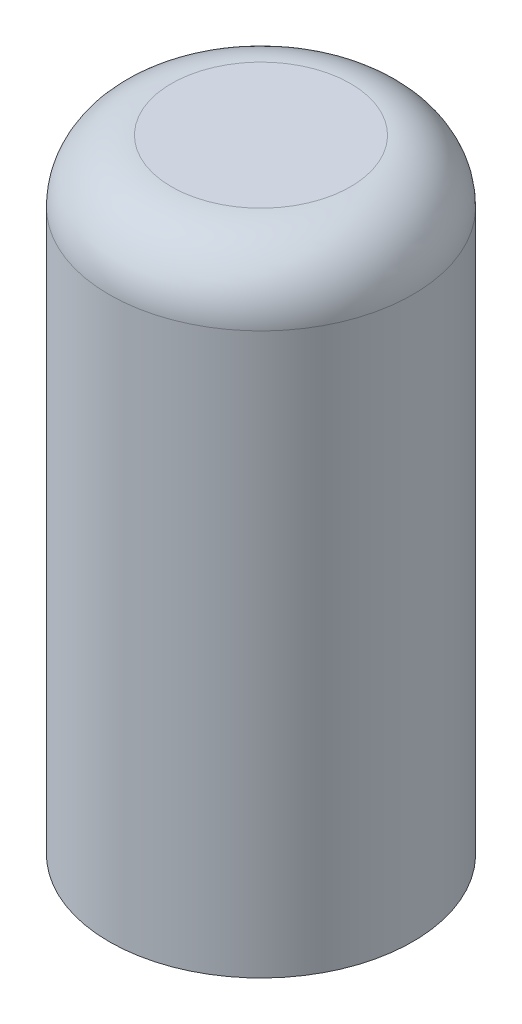
ISO-10303-21;
HEADER;
FILE_DESCRIPTION(('STEP AP214'),'2;1');
FILE_NAME('part.step','',(''),(''),'','','');
FILE_SCHEMA(('AUTOMOTIVE_DESIGN { 1 0 10303 214 1 1 1 1 }'));
ENDSEC;
DATA;
#1=APPLICATION_CONTEXT('core data for automotive mechanical design processes');
#2=APPLICATION_PROTOCOL_DEFINITION('international standard','automotive_design',2000,#1);
#3=PRODUCT_CONTEXT('',#1,'mechanical');
#4=PRODUCT('Part','Part','',(#3));
#5=PRODUCT_RELATED_PRODUCT_CATEGORY('part','',(#4));
#6=PRODUCT_DEFINITION_FORMATION('','',#4);
#7=PRODUCT_DEFINITION_CONTEXT('part definition',#1,'design');
#8=PRODUCT_DEFINITION('design','',#6,#7);
#9=PRODUCT_DEFINITION_SHAPE('','',#8);
#10=(LENGTH_UNIT() NAMED_UNIT(*) SI_UNIT(.MILLI.,.METRE.));
#11=(NAMED_UNIT(*) PLANE_ANGLE_UNIT() SI_UNIT($,.RADIAN.));
#12=(NAMED_UNIT(*) SI_UNIT($,.STERADIAN.) SOLID_ANGLE_UNIT());
#13=UNCERTAINTY_MEASURE_WITH_UNIT(LENGTH_MEASURE(1.E-05),#10,'distance_accuracy_value','');
#14=(GEOMETRIC_REPRESENTATION_CONTEXT(3) GLOBAL_UNCERTAINTY_ASSIGNED_CONTEXT((#13)) GLOBAL_UNIT_ASSIGNED_CONTEXT((#10,
#11,#12)) REPRESENTATION_CONTEXT('',''));
#15=CARTESIAN_POINT('',(0.,0.,0.));
#16=DIRECTION('',(0.,0.,1.));
#17=DIRECTION('',(1.,0.,0.));
#18=AXIS2_PLACEMENT_3D('',#15,#16,#17);
#19=CARTESIAN_POINT('',(0.,650.,0.));
#20=DIRECTION('',(0.,-1.,0.));
#21=DIRECTION('',(0.,0.,-1.));
#22=AXIS2_PLACEMENT_3D('',#19,#20,#21);
#23=CYLINDRICAL_SURFACE('',#22,97.5);
#24=CARTESIAN_POINT('',(0.,610.,0.));
#25=DIRECTION('',(0.,1.,0.));
#26=DIRECTION('',(0.,0.,1.));
#27=AXIS2_PLACEMENT_3D('',#24,#25,#26);
#28=CIRCLE('',#27,97.5);
#29=CARTESIAN_POINT('',(0.,610.,97.5));
#30=VERTEX_POINT('',#29);
#31=EDGE_CURVE('E10',#30,#30,#28,.F.);
#32=ORIENTED_EDGE('',*,*,#31,.T.);
#33=EDGE_LOOP('',(#32));
#34=FACE_BOUND('',#33,.T.);
#35=CARTESIAN_POINT('',(0.,517.5,-97.5));
#36=CARTESIAN_POINT('',(-0.841058769655879,517.500000131074,-97.5000001229896));
#37=CARTESIAN_POINT('',(-1.68211410689393,517.484275204085,-97.4891116312973));
#38=CARTESIAN_POINT('',(-3.3625733468422,517.421436789515,-97.445623930377));
#39=CARTESIAN_POINT('',(-4.20197707672122,517.374320175706,-97.4130225588109));
#40=CARTESIAN_POINT('',(-5.87722091904814,517.248893898886,-97.3263154491367));
#41=CARTESIAN_POINT('',(-6.71306148766499,517.170588357888,-97.2722125527299));
#42=CARTESIAN_POINT('',(-8.37971018981653,516.983085624979,-97.1428286429082));
#43=CARTESIAN_POINT('',(-9.21051776996125,516.873885096868,-97.0675453423283));
#44=CARTESIAN_POINT('',(-10.8655958541269,516.624990036185,-96.8962390654577));
#45=CARTESIAN_POINT('',(-11.6898647817588,516.485288368626,-96.8002112365534));
#46=CARTESIAN_POINT('',(-13.3302223700195,516.175916355791,-96.587987056246));
#47=CARTESIAN_POINT('',(-14.1463101496129,516.006242818687,-96.4717885568083));
#48=CARTESIAN_POINT('',(-15.7687155383474,515.637561585911,-96.2199114152539));
#49=CARTESIAN_POINT('',(-16.5750341022946,515.438556782407,-96.0842346937942));
#50=CARTESIAN_POINT('',(-18.1766731055127,515.011889158601,-95.7941612923735));
#51=CARTESIAN_POINT('',(-18.9719924192853,514.7842234293,-95.639762712258));
#52=CARTESIAN_POINT('',(-21.3315736543071,514.061763240673,-95.1513707260226));
#53=CARTESIAN_POINT('',(-22.8779586744453,513.525563939127,-94.7908477808735));
#54=CARTESIAN_POINT('',(-25.9135076979197,512.348948211736,-94.0063789180784));
#55=CARTESIAN_POINT('',(-27.4026720822885,511.708532480018,-93.5824334228558));
#56=CARTESIAN_POINT('',(-30.3174869793471,510.329917355252,-92.6791655127556));
#57=CARTESIAN_POINT('',(-31.743138054015,509.591718827635,-92.1998435879944));
#58=CARTESIAN_POINT('',(-34.5258511089924,508.023845938994,-91.1943250089744));
#59=CARTESIAN_POINT('',(-35.8829097302275,507.194167104361,-90.6681260625573));
#60=CARTESIAN_POINT('',(-38.6402805472691,505.372761066792,-89.5298475990137));
#61=CARTESIAN_POINT('',(-40.0339817579561,504.37320636702,-88.9142824248913));
#62=CARTESIAN_POINT('',(-42.7320513400252,502.27942494267,-87.6495410647169));
#63=CARTESIAN_POINT('',(-44.0364155064493,501.185193767293,-87.0003632990936));
#64=CARTESIAN_POINT('',(-46.5546722448273,498.906038745041,-85.6792672988249));
#65=CARTESIAN_POINT('',(-47.7684377473407,497.72099207349,-85.0073189777336));
#66=CARTESIAN_POINT('',(-50.1010073905835,495.265951678956,-83.6537960086101));
#67=CARTESIAN_POINT('',(-51.2198059981249,493.995953013995,-82.9722208023684));
#68=CARTESIAN_POINT('',(-53.5438526277285,491.148986538016,-81.4954754480966));
#69=CARTESIAN_POINT('',(-54.7308877983648,489.556784542845,-80.7009240543854));
#70=CARTESIAN_POINT('',(-56.9660666294683,486.263993423805,-79.1389657456395));
#71=CARTESIAN_POINT('',(-58.0141752763636,484.563377135673,-78.3715657091349));
#72=CARTESIAN_POINT('',(-59.4756432904379,481.935877701174,-77.2610669377098));
#73=CARTESIAN_POINT('',(-59.9441264360605,481.047783472077,-76.8978532075739));
#74=CARTESIAN_POINT('',(-60.8434455329142,479.246183538453,-76.18827437373));
#75=CARTESIAN_POINT('',(-61.2742804044033,478.3326771061,-75.841909753376));
#76=CARTESIAN_POINT('',(-62.5080329565272,475.555732567874,-74.8339659024154));
#77=CARTESIAN_POINT('',(-63.2529715295133,473.654484848413,-74.2029407011636));
#78=CARTESIAN_POINT('',(-64.3724522075475,470.358547826576,-73.2311880616067));
#79=CARTESIAN_POINT('',(-64.790544652281,468.987167434664,-72.8607586588913));
#80=CARTESIAN_POINT('',(-65.5416795781276,466.205322212768,-72.1858246415491));
#81=CARTESIAN_POINT('',(-65.8747358661739,464.794863768988,-71.8813093259761));
#82=CARTESIAN_POINT('',(-66.4507960080894,461.943752883125,-71.3491120682116));
#83=CARTESIAN_POINT('',(-66.6939461112358,460.503153541098,-71.1213053994296));
#84=CARTESIAN_POINT('',(-67.0869828480862,457.598311780572,-70.7506898904034));
#85=CARTESIAN_POINT('',(-67.2368695119559,456.134069369719,-70.6078810226669));
#86=CARTESIAN_POINT('',(-67.4411083426006,453.184854457998,-70.4128347794516));
#87=CARTESIAN_POINT('',(-67.494940013156,451.699812699854,-70.3610908811681));
#88=CARTESIAN_POINT('',(-67.5043785417708,448.729127512175,-70.3520356909658));
#89=CARTESIAN_POINT('',(-67.459985582757,447.243484083764,-70.3947242231826));
#90=CARTESIAN_POINT('',(-67.2738286324482,444.283068671458,-70.5726454290871));
#91=CARTESIAN_POINT('',(-67.1320051865069,442.808303881707,-70.7079346099417));
#92=CARTESIAN_POINT('',(-66.7536362818973,439.881727643169,-71.0652469462868));
#93=CARTESIAN_POINT('',(-66.517088771669,438.429916692232,-71.2872719803239));
#94=CARTESIAN_POINT('',(-65.9704393765082,435.645910752998,-71.7933189945174));
#95=CARTESIAN_POINT('',(-65.6656890511374,434.311812734073,-72.0727464451116));
#96=CARTESIAN_POINT('',(-64.9799912353044,431.677803227118,-72.6915662238878));
#97=CARTESIAN_POINT('',(-64.5990493075136,430.377889251182,-73.0309541742037));
#98=CARTESIAN_POINT('',(-63.7645147730452,427.815467528686,-73.7607193505714));
#99=CARTESIAN_POINT('',(-63.3108790810794,426.552982495256,-74.1511267901839));
#100=CARTESIAN_POINT('',(-62.3346744229028,424.068936487996,-74.9736360253282));
#101=CARTESIAN_POINT('',(-61.812094440811,422.847382093235,-75.4057444808568));
#102=CARTESIAN_POINT('',(-60.4151420304235,419.829277491387,-76.533836285721));
#103=CARTESIAN_POINT('',(-59.4980892583007,418.060193391293,-77.2512147100701));
#104=CARTESIAN_POINT('',(-58.0161474830264,415.483929468787,-78.3629970249596));
#105=CARTESIAN_POINT('',(-57.5042631313741,414.637816149105,-78.739666910215));
#106=CARTESIAN_POINT('',(-56.4457922829122,412.971681220428,-79.5018727406844));
#107=CARTESIAN_POINT('',(-55.8992065946864,412.151659004145,-79.8874084791797));
#108=CARTESIAN_POINT('',(-54.2066245309442,409.728680092151,-81.0541211889856));
#109=CARTESIAN_POINT('',(-53.0093230905132,408.165448346478,-81.8442482577446));
#110=CARTESIAN_POINT('',(-50.4837212715677,405.150125320249,-83.4258027761796));
#111=CARTESIAN_POINT('',(-49.1554371145908,403.698020316678,-84.2172300529237));
#112=CARTESIAN_POINT('',(-46.3568268550921,400.895439710074,-85.789851348241));
#113=CARTESIAN_POINT('',(-44.885139118274,399.546210631213,-86.5708467253269));
#114=CARTESIAN_POINT('',(-41.815601541671,396.974411864322,-88.0944949107013));
#115=CARTESIAN_POINT('',(-40.2177402288645,395.751853717963,-88.837144221986));
#116=CARTESIAN_POINT('',(-37.732599159874,394.022166220727,-89.9072516592096));
#117=CARTESIAN_POINT('',(-36.8901501829687,393.463337248748,-90.2564007795345));
#118=CARTESIAN_POINT('',(-35.1761946674018,392.381321483449,-90.9380857260168));
#119=CARTESIAN_POINT('',(-34.3046916433119,391.858130402265,-91.2706235495165));
#120=CARTESIAN_POINT('',(-32.5337664697387,390.848986108771,-91.9167682576983));
#121=CARTESIAN_POINT('',(-31.6343493315236,390.363026266253,-92.2303785109151));
#122=CARTESIAN_POINT('',(-29.8087919840112,389.429900791862,-92.8364753156058));
#123=CARTESIAN_POINT('',(-28.8826534851014,388.982732684306,-93.1289632149052));
#124=CARTESIAN_POINT('',(-26.4825572070576,387.891226830316,-93.8469429645498));
#125=CARTESIAN_POINT('',(-24.9904145873387,387.275560726021,-94.2559266238759));
#126=CARTESIAN_POINT('',(-21.9517006765951,386.148620830874,-95.0095953671133));
#127=CARTESIAN_POINT('',(-20.4051369659291,385.637332568098,-95.3542893641739));
#128=CARTESIAN_POINT('',(-17.266531413211,384.72530629406,-95.9722519280153));
#129=CARTESIAN_POINT('',(-15.674512886748,384.324512691232,-96.2455564083132));
#130=CARTESIAN_POINT('',(-12.454451018113,383.638517525164,-96.7149612880226));
#131=CARTESIAN_POINT('',(-10.8264069113131,383.353318417856,-96.9110600471115));
#132=CARTESIAN_POINT('',(-7.53974785300756,382.901833467091,-97.222101459197));
#133=CARTESIAN_POINT('',(-5.88103963745256,382.73600764206,-97.3367301367258));
#134=CARTESIAN_POINT('',(-2.55217998153672,382.52765424955,-97.4808276111811));
#135=CARTESIAN_POINT('',(-0.8820285460783,382.485126629253,-97.5102964445889));
#136=CARTESIAN_POINT('',(2.45612665393036,382.524050663574,-97.4833501574838));
#137=CARTESIAN_POINT('',(4.12413041115404,382.60550274002,-97.4269347447598));
#138=CARTESIAN_POINT('',(7.44448423057918,382.891087804018,-97.229601634782));
#139=CARTESIAN_POINT('',(9.09683477994216,383.095216960771,-97.0886865761737));
#140=CARTESIAN_POINT('',(12.2738167332787,383.606976303807,-96.736763553081));
#141=CARTESIAN_POINT('',(13.8001193986528,383.907583821032,-96.5305213015223));
#142=CARTESIAN_POINT('',(16.8182005718024,384.610407971798,-96.0506784096405));
#143=CARTESIAN_POINT('',(18.3099807717222,385.012619613573,-95.77708107846));
#144=CARTESIAN_POINT('',(21.2509611909264,385.914021898447,-95.167758787226));
#145=CARTESIAN_POINT('',(22.700157990089,386.413220306743,-94.8320288526584));
#146=CARTESIAN_POINT('',(25.5490529231857,387.503419782869,-94.1045045290518));
#147=CARTESIAN_POINT('',(26.9487482853309,388.094425981435,-93.7127070067372));
#148=CARTESIAN_POINT('',(29.7956147658313,389.410308730664,-92.8485127627575));
#149=CARTESIAN_POINT('',(31.2385210393806,390.141887770652,-92.3722814292721));
#150=CARTESIAN_POINT('',(34.0553647496094,391.698438572814,-91.3713129587121));
#151=CARTESIAN_POINT('',(35.4292994679814,392.523414011764,-90.8465739121632));
#152=CARTESIAN_POINT('',(38.1048837530086,394.261198788088,-89.7572020694093));
#153=CARTESIAN_POINT('',(39.4064944714931,395.174054623871,-89.1925481963159));
#154=CARTESIAN_POINT('',(41.933631748725,397.081878873506,-88.0326866505505));
#155=CARTESIAN_POINT('',(43.159154202171,398.076851711204,-87.4374773324357));
#156=CARTESIAN_POINT('',(45.7334563124867,400.320119872926,-86.1227567780688));
#157=CARTESIAN_POINT('',(47.0677818010393,401.582728114568,-85.399313182882));
#158=CARTESIAN_POINT('',(49.6258563322756,404.208247133162,-83.938633966364));
#159=CARTESIAN_POINT('',(50.8495889275213,405.571172774865,-83.2013963131873));
#160=CARTESIAN_POINT('',(53.1838049211151,408.393642759901,-81.7290525581094));
#161=CARTESIAN_POINT('',(54.2942128479666,409.853250437999,-80.9939481894175));
#162=CARTESIAN_POINT('',(56.3967753541518,412.864765044543,-79.5442252496152));
#163=CARTESIAN_POINT('',(57.3889454919879,414.416659788878,-78.8296039926225));
#164=CARTESIAN_POINT('',(59.1436520346959,417.427648891688,-77.519912021589));
#165=CARTESIAN_POINT('',(59.9194729027744,418.877117365786,-76.9205058727223));
#166=CARTESIAN_POINT('',(61.3695954992595,421.844202772217,-75.7685961823368));
#167=CARTESIAN_POINT('',(62.0438965136772,423.361820183745,-75.2160929706981));
#168=CARTESIAN_POINT('',(63.2839951939035,426.459304102406,-74.1757393383543));
#169=CARTESIAN_POINT('',(63.8499663044206,428.039066137575,-73.68778596187));
#170=CARTESIAN_POINT('',(64.867664792584,431.257476444707,-72.7935147031526));
#171=CARTESIAN_POINT('',(65.3194199173756,432.896110303908,-72.387176998496));
#172=CARTESIAN_POINT('',(66.0280312291772,435.911755500848,-71.7407415618537));
#173=CARTESIAN_POINT('',(66.3055419109814,437.280309696444,-71.483762985774));
#174=CARTESIAN_POINT('',(66.7763748667453,440.043636259976,-71.0441410429634));
#175=CARTESIAN_POINT('',(66.9697075658925,441.438405358944,-70.8614884713659));
#176=CARTESIAN_POINT('',(67.2689335025054,444.244218962747,-70.5774992355427));
#177=CARTESIAN_POINT('',(67.3749110091313,445.655246447696,-70.4760842063559));
#178=CARTESIAN_POINT('',(67.4978468283115,448.484788252271,-70.3583547399727));
#179=CARTESIAN_POINT('',(67.5148038910335,449.903302676732,-70.3420414975913));
#180=CARTESIAN_POINT('',(67.4593627868347,452.737593020832,-70.3952113161187));
#181=CARTESIAN_POINT('',(67.3869241020864,454.153367407195,-70.4647332810784));
#182=CARTESIAN_POINT('',(67.1539579042256,456.970978369522,-70.6867848438324));
#183=CARTESIAN_POINT('',(66.9934309191762,458.372815028987,-70.8393139440237));
#184=CARTESIAN_POINT('',(66.5867490614229,461.154998978869,-71.221713489735));
#185=CARTESIAN_POINT('',(66.340488506313,462.535317540032,-71.4516793788311));
#186=CARTESIAN_POINT('',(65.7660163823356,465.265246597227,-71.9807833555996));
#187=CARTESIAN_POINT('',(65.4377938477496,466.614852957881,-72.279930698684));
#188=CARTESIAN_POINT('',(64.5937777910564,469.675089263686,-73.0363174365625));
#189=CARTESIAN_POINT('',(64.0512383775696,471.373302143363,-73.5140958447887));
#190=CARTESIAN_POINT('',(62.8432903016605,474.700319298426,-74.5493317490452));
#191=CARTESIAN_POINT('',(62.1778433157733,476.329101729396,-75.1068140850503));
#192=CARTESIAN_POINT('',(60.7308320145228,479.514049443108,-76.2816185285041));
#193=CARTESIAN_POINT('',(59.9491324848465,481.070127355361,-76.8990100222664));
#194=CARTESIAN_POINT('',(58.2763425976617,484.104538286452,-78.1743179290407));
#195=CARTESIAN_POINT('',(57.3852590987321,485.582876171441,-78.8322317999365));
#196=CARTESIAN_POINT('',(55.4771144677629,488.491992245766,-80.1869032477321));
#197=CARTESIAN_POINT('',(54.4576714181876,489.920953883018,-80.8842015810297));
#198=CARTESIAN_POINT('',(52.3130890254323,492.692632858549,-82.2875015857658));
#199=CARTESIAN_POINT('',(51.1879498374726,494.035350323479,-82.9935032444217));
#200=CARTESIAN_POINT('',(48.8347172805761,496.6314355628,-84.3996449516463));
#201=CARTESIAN_POINT('',(47.6065930269225,497.884776323534,-85.0997831720627));
#202=CARTESIAN_POINT('',(45.0501719584955,500.297319306489,-86.4802969723416));
#203=CARTESIAN_POINT('',(43.7218657481426,501.456512677857,-87.1606706902781));
#204=CARTESIAN_POINT('',(41.5457857700001,503.209510176549,-88.2098993118906));
#205=CARTESIAN_POINT('',(40.7299427899988,503.836655034426,-88.589802795815));
#206=CARTESIAN_POINT('',(39.066343624892,505.055735307727,-89.3358914544837));
#207=CARTESIAN_POINT('',(38.2185904597825,505.647674041464,-89.7020779209015));
#208=CARTESIAN_POINT('',(36.4917300624657,506.795058082861,-90.4183484821805));
#209=CARTESIAN_POINT('',(35.6126134591042,507.350492339959,-90.7684276915536));
#210=CARTESIAN_POINT('',(33.8243931886395,508.423002501641,-91.4498537947872));
#211=CARTESIAN_POINT('',(32.9152937821163,508.940083822569,-91.7812033321429));
#212=CARTESIAN_POINT('',(31.0691760344544,509.933746870017,-92.4224546754079));
#213=CARTESIAN_POINT('',(30.1321877671728,510.410370229418,-92.7323784667856));
#214=CARTESIAN_POINT('',(28.2309826068363,511.321878348899,-93.3287414479659));
#215=CARTESIAN_POINT('',(27.2667696548899,511.7567691106,-93.6151840137686));
#216=CARTESIAN_POINT('',(25.3129379677866,512.582984574341,-94.1622756199132));
#217=CARTESIAN_POINT('',(24.3233246816418,512.974318525862,-94.4229301351498));
#218=CARTESIAN_POINT('',(22.3205703247798,513.711699087201,-94.9163078971732));
#219=CARTESIAN_POINT('',(21.3074309624801,514.057748973423,-95.1490331646039));
#220=CARTESIAN_POINT('',(19.4753093467485,514.634981850316,-95.5387127234386));
#221=CARTESIAN_POINT('',(18.6603007915605,514.875017213867,-95.7013093373722));
#222=CARTESIAN_POINT('',(17.0183064833653,515.324971199788,-96.0068985800616));
#223=CARTESIAN_POINT('',(16.1913200835958,515.534888189145,-96.1498901458164));
#224=CARTESIAN_POINT('',(14.5269891104443,515.923795359244,-96.4153857485531));
#225=CARTESIAN_POINT('',(13.6896461896107,516.102790407558,-96.5378930099703));
#226=CARTESIAN_POINT('',(12.0060231713148,516.429215447988,-96.7616997886046));
#227=CARTESIAN_POINT('',(11.1597431864686,516.576645837354,-96.8629995727233));
#228=CARTESIAN_POINT('',(9.46046752987578,516.839271167955,-97.0436968314115));
#229=CARTESIAN_POINT('',(8.60747684577776,516.954488081861,-97.1231092347402));
#230=CARTESIAN_POINT('',(6.89603458935004,517.152339235733,-97.259608961069));
#231=CARTESIAN_POINT('',(6.03758360121015,517.234976903646,-97.3166986328339));
#232=CARTESIAN_POINT('',(4.31688403856741,517.367344769873,-97.4081970531133));
#233=CARTESIAN_POINT('',(3.45463521818759,517.417072805085,-97.4426043107455));
#234=CARTESIAN_POINT('',(1.7282563841433,517.483400265393,-97.4885056605433));
#235=CARTESIAN_POINT('',(0.864126380431263,517.499999865331,-97.4999998736372));
#236=CARTESIAN_POINT('',(0.,517.5,-97.5));
#237=B_SPLINE_CURVE_WITH_KNOTS('',3,(#35,#36,#37,#38,#39,#40,#41,#42,#43,#44,#45,#46,#47,#48,
#49,#50,#51,#52,#53,#54,#55,#56,#57,#58,#59,#60,#61,#62,#63,#64,#65,#66,#67,#68,#69,#70,#71,#72,
#73,#74,#75,#76,#77,#78,#79,#80,#81,#82,#83,#84,#85,#86,#87,#88,#89,#90,#91,#92,#93,#94,#95,#96,
#97,#98,#99,#100,#101,#102,#103,#104,#105,#106,#107,#108,#109,#110,#111,#112,#113,#114,#115,
#116,#117,#118,#119,#120,#121,#122,#123,#124,#125,#126,#127,#128,#129,#130,#131,#132,#133,#134,
#135,#136,#137,#138,#139,#140,#141,#142,#143,#144,#145,#146,#147,#148,#149,#150,#151,#152,#153,
#154,#155,#156,#157,#158,#159,#160,#161,#162,#163,#164,#165,#166,#167,#168,#169,#170,#171,#172,
#173,#174,#175,#176,#177,#178,#179,#180,#181,#182,#183,#184,#185,#186,#187,#188,#189,#190,#191,
#192,#193,#194,#195,#196,#197,#198,#199,#200,#201,#202,#203,#204,#205,#206,#207,#208,#209,#210,
#211,#212,#213,#214,#215,#216,#217,#218,#219,#220,#221,#222,#223,#224,#225,#226,#227,#228,#229,
#230,#231,#232,#233,#234,#235,#236),.UNSPECIFIED.,.T.,.F.,(4,2,2,2,2,2,2,2,2,2,2,2,2,2,2,2,2,2,
2,2,2,2,2,2,2,2,2,2,2,2,2,2,2,2,2,2,2,2,2,2,2,2,2,2,2,2,2,2,2,2,2,2,2,2,2,2,2,2,2,2,2,2,2,2,2,2,
2,2,2,2,2,2,2,2,2,2,2,2,2,2,2,2,2,2,2,2,2,2,2,2,2,2,2,2,2,2,2,2,2,2,4),(0.,2.52295342733796,
5.0461581476677,7.56902950507501,10.0921733992525,12.6159081541152,15.1399118340571,
17.6636668044567,20.1876781353294,25.2093250898728,30.2309385994224,35.2525076679183,
40.274322412326,45.7356931034151,51.1973206764649,56.6664698868377,62.1359375354244,
68.545853207471,74.9573813075932,78.1596803481037,81.3620711995473,87.7617899575892,
92.2003681703993,96.6382252525443,101.068831233119,105.499435780628,109.953976503025,
114.4085089296,118.865762046424,123.323111704887,127.509235727504,131.69505423695,
135.883362902397,140.072341585806,146.416202604698,149.590118030262,152.763959526809,
159.121379428594,165.478012982991,171.902319252907,178.327210362141,181.534910399172,
184.742223809356,187.948964721333,191.155500828815,196.145535462019,201.134877759354,
206.121705241595,211.108638668887,216.114688402751,221.120735992093,226.126800613966,
231.132708921086,235.835225188828,240.537510468899,245.240172390385,249.943097217681,
254.997355483498,260.05181279165,265.108959318749,270.166378464783,276.083391549002,
282.001283171616,287.92309059591,293.844117927581,299.089316268742,304.334551497644,
309.571317125492,314.806809330714,319.062085655404,323.316834827044,327.567474739317,
331.818174329718,336.070801219684,340.323402616698,344.581264798093,348.839696945675,
354.368597007575,359.899223939573,365.436334641947,370.973098334325,376.634344569887,
382.295582491748,387.95852430491,393.621997879902,396.911803703789,400.201298957777,
403.491785457661,406.781806374535,410.06839961271,413.35451949097,416.639940210441,
419.925123090635,422.519463939346,425.11394539967,427.708018077291,430.302058105853,
432.894324410173,435.486317886615,438.078481714048,440.670631860766),.UNSPECIFIED.);
#238=CARTESIAN_POINT('',(0.,517.5,-97.5));
#239=VERTEX_POINT('',#238);
#240=EDGE_CURVE('E51',#239,#239,#237,.T.);
#241=ORIENTED_EDGE('',*,*,#240,.T.);
#242=EDGE_LOOP('',(#241));
#243=FACE_BOUND('',#242,.T.);
#244=CARTESIAN_POINT('',(0.,250.,0.));
#245=DIRECTION('',(0.,-1.,0.));
#246=DIRECTION('',(0.,0.,-1.));
#247=AXIS2_PLACEMENT_3D('',#244,#245,#246);
#248=CIRCLE('',#247,97.5);
#249=CARTESIAN_POINT('',(0.,250.,-97.5));
#250=VERTEX_POINT('',#249);
#251=EDGE_CURVE('E56',#250,#250,#248,.T.);
#252=ORIENTED_EDGE('',*,*,#251,.F.);
#253=EDGE_LOOP('',(#252));
#254=FACE_BOUND('',#253,.T.);
#255=ADVANCED_FACE('F38',(#34,#243,#254),#23,.T.);
#256=CARTESIAN_POINT('',(0.,650.,0.));
#257=DIRECTION('',(0.,1.,0.));
#258=DIRECTION('',(0.,0.,1.));
#259=AXIS2_PLACEMENT_3D('',#256,#257,#258);
#260=PLANE('',#259);
#261=CARTESIAN_POINT('',(0.,650.,0.));
#262=DIRECTION('',(0.,1.,0.));
#263=DIRECTION('',(0.,0.,1.));
#264=AXIS2_PLACEMENT_3D('',#261,#262,#263);
#265=CIRCLE('',#264,57.5);
#266=CARTESIAN_POINT('',(0.,650.,57.5));
#267=VERTEX_POINT('',#266);
#268=EDGE_CURVE('E46',#267,#267,#265,.T.);
#269=ORIENTED_EDGE('',*,*,#268,.T.);
#270=EDGE_LOOP('',(#269));
#271=FACE_BOUND('',#270,.T.);
#272=ADVANCED_FACE('F76',(#271),#260,.T.);
#273=CARTESIAN_POINT('',(0.,250.,0.));
#274=DIRECTION('',(0.,-1.,0.));
#275=DIRECTION('',(0.,0.,-1.));
#276=AXIS2_PLACEMENT_3D('',#273,#274,#275);
#277=PLANE('',#276);
#278=CARTESIAN_POINT('',(0.,250.,0.));
#279=DIRECTION('',(0.,-1.,0.));
#280=DIRECTION('',(0.,0.,-1.));
#281=AXIS2_PLACEMENT_3D('',#278,#279,#280);
#282=CIRCLE('',#281,67.5);
#283=CARTESIAN_POINT('',(0.,250.,-67.5));
#284=VERTEX_POINT('',#283);
#285=EDGE_CURVE('E94',#284,#284,#282,.T.);
#286=ORIENTED_EDGE('',*,*,#285,.F.);
#287=EDGE_LOOP('',(#286));
#288=FACE_BOUND('',#287,.T.);
#289=ORIENTED_EDGE('',*,*,#251,.T.);
#290=EDGE_LOOP('',(#289));
#291=FACE_BOUND('',#290,.T.);
#292=ADVANCED_FACE('F72',(#288,#291),#277,.T.);
#293=CARTESIAN_POINT('',(0.,450.,-97.5));
#294=DIRECTION('',(0.,0.,1.));
#295=DIRECTION('',(1.,0.,0.));
#296=AXIS2_PLACEMENT_3D('',#293,#294,#295);
#297=CYLINDRICAL_SURFACE('',#296,67.5);
#298=CARTESIAN_POINT('',(0.,450.,0.));
#299=DIRECTION('',(0.,0.,1.));
#300=DIRECTION('',(1.,0.,0.));
#301=AXIS2_PLACEMENT_3D('',#298,#299,#300);
#302=CIRCLE('',#301,67.5);
#303=CARTESIAN_POINT('',(67.5,450.,0.));
#304=VERTEX_POINT('',#303);
#305=EDGE_CURVE('E91',#304,#304,#302,.T.);
#306=ORIENTED_EDGE('',*,*,#305,.T.);
#307=EDGE_LOOP('',(#306));
#308=FACE_BOUND('',#307,.T.);
#309=ORIENTED_EDGE('',*,*,#240,.F.);
#310=EDGE_LOOP('',(#309));
#311=FACE_BOUND('',#310,.T.);
#312=ADVANCED_FACE('F66',(#308,#311),#297,.F.);
#313=CARTESIAN_POINT('',(0.,450.,0.));
#314=DIRECTION('',(0.,0.,1.));
#315=DIRECTION('',(1.,0.,0.));
#316=AXIS2_PLACEMENT_3D('',#313,#314,#315);
#317=PLANE('',#316);
#318=ORIENTED_EDGE('',*,*,#305,.F.);
#319=EDGE_LOOP('',(#318));
#320=FACE_BOUND('',#319,.T.);
#321=ADVANCED_FACE('F71',(#320),#317,.F.);
#322=CARTESIAN_POINT('',(0.,610.,0.));
#323=DIRECTION('',(0.,1.,0.));
#324=DIRECTION('',(0.,0.,1.));
#325=AXIS2_PLACEMENT_3D('',#322,#323,#324);
#326=TOROIDAL_SURFACE('',#325,57.5,40.);
#327=ORIENTED_EDGE('',*,*,#31,.F.);
#328=EDGE_LOOP('',(#327));
#329=FACE_BOUND('',#328,.T.);
#330=ORIENTED_EDGE('',*,*,#268,.F.);
#331=EDGE_LOOP('',(#330));
#332=FACE_BOUND('',#331,.T.);
#333=ADVANCED_FACE('F40',(#329,#332),#326,.T.);
#334=CARTESIAN_POINT('',(0.,350.,0.));
#335=DIRECTION('',(0.,-1.,0.));
#336=DIRECTION('',(0.,0.,-1.));
#337=AXIS2_PLACEMENT_3D('',#334,#335,#336);
#338=CYLINDRICAL_SURFACE('',#337,67.5);
#339=ORIENTED_EDGE('',*,*,#285,.T.);
#340=EDGE_LOOP('',(#339));
#341=FACE_BOUND('',#340,.T.);
#342=CARTESIAN_POINT('',(0.,350.,0.));
#343=DIRECTION('',(0.,-1.,0.));
#344=DIRECTION('',(0.,0.,-1.));
#345=AXIS2_PLACEMENT_3D('',#342,#343,#344);
#346=CIRCLE('',#345,67.5);
#347=CARTESIAN_POINT('',(0.,350.,-67.5));
#348=VERTEX_POINT('',#347);
#349=EDGE_CURVE('E98',#348,#348,#346,.T.);
#350=ORIENTED_EDGE('',*,*,#349,.F.);
#351=EDGE_LOOP('',(#350));
#352=FACE_BOUND('',#351,.T.);
#353=ADVANCED_FACE('F107',(#341,#352),#338,.F.);
#354=CARTESIAN_POINT('',(0.,350.,0.));
#355=DIRECTION('',(0.,-1.,0.));
#356=DIRECTION('',(0.,0.,-1.));
#357=AXIS2_PLACEMENT_3D('',#354,#355,#356);
#358=PLANE('',#357);
#359=ORIENTED_EDGE('',*,*,#349,.T.);
#360=EDGE_LOOP('',(#359));
#361=FACE_BOUND('',#360,.T.);
#362=ADVANCED_FACE('F105',(#361),#358,.T.);
#363=CLOSED_SHELL('',(#255,#272,#292,#312,#321,#333,#353,#362));
#364=MANIFOLD_SOLID_BREP('B2',#363);
#365=ADVANCED_BREP_SHAPE_REPRESENTATION('',(#18,#364),#14);
#366=SHAPE_DEFINITION_REPRESENTATION(#9,#365);
ENDSEC;
END-ISO-10303-21;
